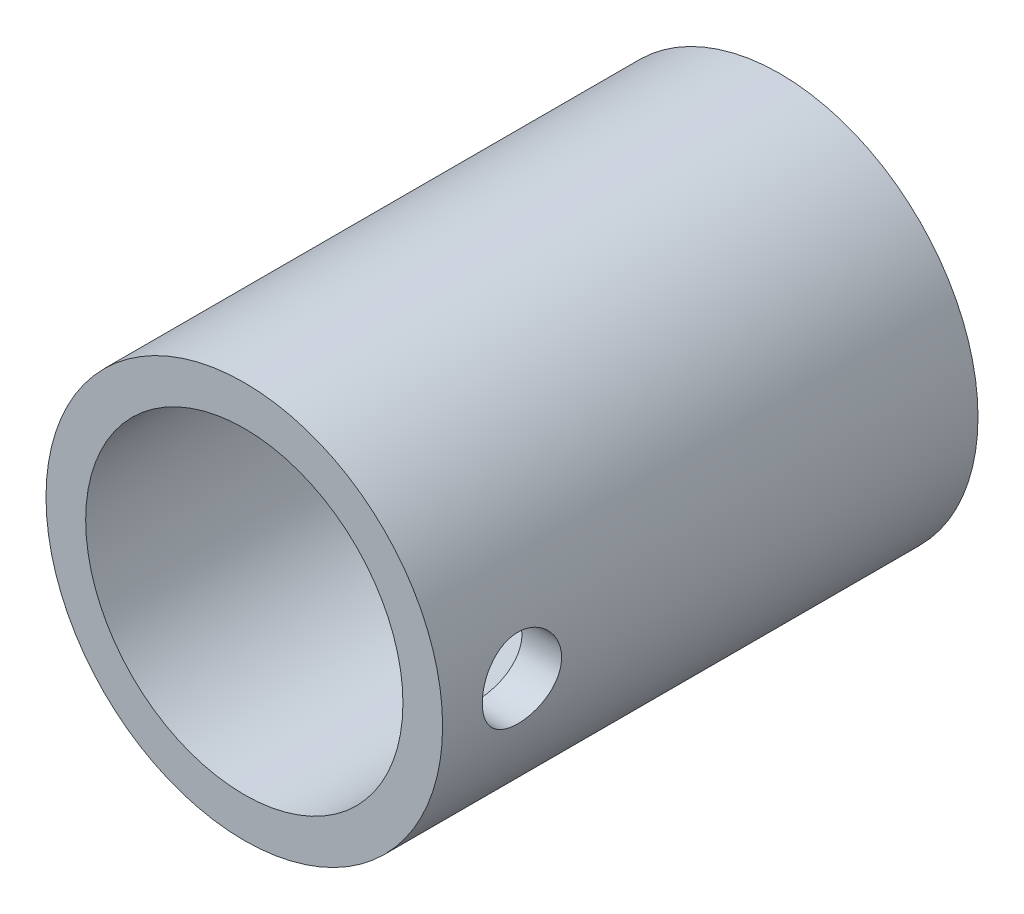
ISO-10303-21;
HEADER;
FILE_DESCRIPTION(('STEP AP214'),'2;1');
FILE_NAME('part.step','',(''),(''),'','','');
FILE_SCHEMA(('AUTOMOTIVE_DESIGN { 1 0 10303 214 1 1 1 1 }'));
ENDSEC;
DATA;
#1=APPLICATION_CONTEXT('core data for automotive mechanical design processes');
#2=APPLICATION_PROTOCOL_DEFINITION('international standard','automotive_design',2000,#1);
#3=PRODUCT_CONTEXT('',#1,'mechanical');
#4=PRODUCT('Part','Part','',(#3));
#5=PRODUCT_RELATED_PRODUCT_CATEGORY('part','',(#4));
#6=PRODUCT_DEFINITION_FORMATION('','',#4);
#7=PRODUCT_DEFINITION_CONTEXT('part definition',#1,'design');
#8=PRODUCT_DEFINITION('design','',#6,#7);
#9=PRODUCT_DEFINITION_SHAPE('','',#8);
#10=(LENGTH_UNIT() NAMED_UNIT(*) SI_UNIT(.MILLI.,.METRE.));
#11=(NAMED_UNIT(*) PLANE_ANGLE_UNIT() SI_UNIT($,.RADIAN.));
#12=(NAMED_UNIT(*) SI_UNIT($,.STERADIAN.) SOLID_ANGLE_UNIT());
#13=UNCERTAINTY_MEASURE_WITH_UNIT(LENGTH_MEASURE(1.E-05),#10,'distance_accuracy_value','');
#14=(GEOMETRIC_REPRESENTATION_CONTEXT(3) GLOBAL_UNCERTAINTY_ASSIGNED_CONTEXT((#13)) GLOBAL_UNIT_ASSIGNED_CONTEXT((#10,
#11,#12)) REPRESENTATION_CONTEXT('',''));
#15=CARTESIAN_POINT('',(0.,0.,0.));
#16=DIRECTION('',(0.,0.,1.));
#17=DIRECTION('',(1.,0.,0.));
#18=AXIS2_PLACEMENT_3D('',#15,#16,#17);
#19=CARTESIAN_POINT('',(0.,0.,13.5));
#20=DIRECTION('',(0.,0.,-1.));
#21=DIRECTION('',(-1.,0.,0.));
#22=AXIS2_PLACEMENT_3D('',#19,#20,#21);
#23=CYLINDRICAL_SURFACE('',#22,5.);
#24=CARTESIAN_POINT('',(0.,0.,13.5));
#25=DIRECTION('',(0.,0.,1.));
#26=DIRECTION('',(1.,0.,0.));
#27=AXIS2_PLACEMENT_3D('',#24,#25,#26);
#28=CIRCLE('',#27,5.);
#29=CARTESIAN_POINT('',(5.,0.,13.5));
#30=VERTEX_POINT('',#29);
#31=EDGE_CURVE('E10',#30,#30,#28,.T.);
#32=ORIENTED_EDGE('',*,*,#31,.F.);
#33=EDGE_LOOP('',(#32));
#34=FACE_BOUND('',#33,.T.);
#35=CARTESIAN_POINT('',(0.,0.,0.));
#36=DIRECTION('',(0.,0.,1.));
#37=DIRECTION('',(1.,0.,0.));
#38=AXIS2_PLACEMENT_3D('',#35,#36,#37);
#39=CIRCLE('',#38,5.);
#40=CARTESIAN_POINT('',(5.,0.,0.));
#41=VERTEX_POINT('',#40);
#42=EDGE_CURVE('E45',#41,#41,#39,.T.);
#43=ORIENTED_EDGE('',*,*,#42,.T.);
#44=EDGE_LOOP('',(#43));
#45=FACE_BOUND('',#44,.T.);
#46=CARTESIAN_POINT('',(5.,0.,12.5));
#47=CARTESIAN_POINT('',(4.99999897580871,-0.0555769067926333,12.4999979555017));
#48=CARTESIAN_POINT('',(4.99906385178231,-0.111179660201523,12.4953511570324));
#49=CARTESIAN_POINT('',(4.99542365623231,-0.22081350768902,12.4769014998848));
#50=CARTESIAN_POINT('',(4.99271717860186,-0.274843317541356,12.4630913671985));
#51=CARTESIAN_POINT('',(4.98583649278287,-0.379730305263313,12.4267587263792));
#52=CARTESIAN_POINT('',(4.98166369076718,-0.430590467933134,12.4042445631553));
#53=CARTESIAN_POINT('',(4.97230398035314,-0.527807988864225,12.3511677524887));
#54=CARTESIAN_POINT('',(4.96711713235707,-0.574165615075812,12.3206055843928));
#55=CARTESIAN_POINT('',(4.9562216532997,-0.661693477314866,12.2518615057086));
#56=CARTESIAN_POINT('',(4.95050745504347,-0.702793951158525,12.2135916446088));
#57=CARTESIAN_POINT('',(4.93924180452588,-0.778036756608029,12.1307075836083));
#58=CARTESIAN_POINT('',(4.93369036500424,-0.812178544770425,12.0860928886649));
#59=CARTESIAN_POINT('',(4.92332441812615,-0.872831753347621,11.9912838069881));
#60=CARTESIAN_POINT('',(4.91851707364946,-0.899270938865868,11.9410423562036));
#61=CARTESIAN_POINT('',(4.91026268058418,-0.943305666580309,11.8367181809959));
#62=CARTESIAN_POINT('',(4.90681549761962,-0.960902082437239,11.7826358366537));
#63=CARTESIAN_POINT('',(4.90172805252204,-0.986525299884828,11.6729156360921));
#64=CARTESIAN_POINT('',(4.90006470107188,-0.994674497958778,11.6173074558578));
#65=CARTESIAN_POINT('',(4.89866375060627,-1.00155212772612,11.5054901786357));
#66=CARTESIAN_POINT('',(4.89892595467841,-1.0002815227135,11.4492811436799));
#67=CARTESIAN_POINT('',(4.90132551148185,-0.98845457310182,11.338753211979));
#68=CARTESIAN_POINT('',(4.90343452858763,-0.978038540243907,11.2844185943727));
#69=CARTESIAN_POINT('',(4.90924546160001,-0.948437884623052,11.178283923337));
#70=CARTESIAN_POINT('',(4.91294745357779,-0.929252843100682,11.126483991081));
#71=CARTESIAN_POINT('',(4.92155618500408,-0.882524783674721,11.0264847382964));
#72=CARTESIAN_POINT('',(4.92647089813704,-0.854926151232116,10.9783121204308));
#73=CARTESIAN_POINT('',(4.93694618773062,-0.792193574572681,10.8872291500272));
#74=CARTESIAN_POINT('',(4.94250683838366,-0.75705876435683,10.8443194031488));
#75=CARTESIAN_POINT('',(4.95377021241462,-0.679499934560585,10.7641705975431));
#76=CARTESIAN_POINT('',(4.95947369210905,-0.636956161212446,10.7270474321409));
#77=CARTESIAN_POINT('',(4.97028848714408,-0.546185024062011,10.6604461536988));
#78=CARTESIAN_POINT('',(4.97539979488974,-0.49795758737939,10.6309681387064));
#79=CARTESIAN_POINT('',(4.98446690160887,-0.397059386878922,10.580472490774));
#80=CARTESIAN_POINT('',(4.98842088848272,-0.344381819585301,10.5594681063555));
#81=CARTESIAN_POINT('',(4.99471408987858,-0.236148976448666,10.5266395259614));
#82=CARTESIAN_POINT('',(4.99705350000531,-0.180594050072451,10.5148142179264));
#83=CARTESIAN_POINT('',(4.99982671866868,-0.0691794056271513,10.5008435462057));
#84=CARTESIAN_POINT('',(5.0002917465247,-0.0133403283255771,10.4985395804597));
#85=CARTESIAN_POINT('',(4.99935051930103,0.0979249341927132,10.5032498589422));
#86=CARTESIAN_POINT('',(4.99794436941446,0.153351142443792,10.5102635793526));
#87=CARTESIAN_POINT('',(4.99343832008018,0.26170565994654,10.533278373544));
#88=CARTESIAN_POINT('',(4.99035376404206,0.314651948339903,10.5491980684979));
#89=CARTESIAN_POINT('',(4.98283552061033,0.417123627499667,10.5894839826558));
#90=CARTESIAN_POINT('',(4.97840173214227,0.466648761637539,10.6138508346768));
#91=CARTESIAN_POINT('',(4.96859911533294,0.561541173686217,10.6706824906513));
#92=CARTESIAN_POINT('',(4.96321950437052,0.606850126752188,10.7032427810389));
#93=CARTESIAN_POINT('',(4.95214734829882,0.691418019119207,10.7754091912073));
#94=CARTESIAN_POINT('',(4.94645476968388,0.730676308930763,10.8150160663999));
#95=CARTESIAN_POINT('',(4.93529303556965,0.802640590774177,10.9008733518911));
#96=CARTESIAN_POINT('',(4.92982860233304,0.835237702448656,10.9472157442213));
#97=CARTESIAN_POINT('',(4.91984191796194,0.892185420051207,11.0448113613567));
#98=CARTESIAN_POINT('',(4.91531962913342,0.916536355922904,11.0960643895736));
#99=CARTESIAN_POINT('',(4.90776740584383,0.956151841581961,11.2017682461495));
#100=CARTESIAN_POINT('',(4.90472974872187,0.971463499791052,11.2562008412103));
#101=CARTESIAN_POINT('',(4.90047436792025,0.992708651627198,11.3669334534909));
#102=CARTESIAN_POINT('',(4.89925640691111,0.998643368225114,11.4232332262093));
#103=CARTESIAN_POINT('',(4.89879149631379,1.00092091086747,11.5350088645443));
#104=CARTESIAN_POINT('',(4.89950919189301,0.997435788070897,11.590481148927));
#105=CARTESIAN_POINT('',(4.90275573484614,0.981352304100062,11.700031649905));
#106=CARTESIAN_POINT('',(4.90528456767169,0.9687540161293,11.7541098776948));
#107=CARTESIAN_POINT('',(4.91185264219158,0.934878568498956,11.8592277112405));
#108=CARTESIAN_POINT('',(4.9158882101883,0.913622506717347,11.9102743605024));
#109=CARTESIAN_POINT('',(4.9250171497417,0.863054644601606,12.0081037207344));
#110=CARTESIAN_POINT('',(4.93011060998894,0.833742168774884,12.0548860737251));
#111=CARTESIAN_POINT('',(4.94088960523225,0.767305914786416,12.1437155721503));
#112=CARTESIAN_POINT('',(4.94658372909699,0.730057887235182,12.1856687652676));
#113=CARTESIAN_POINT('',(4.95786081871955,0.649064369013143,12.2627862055292));
#114=CARTESIAN_POINT('',(4.96344375863184,0.605317387153337,12.2979488903173));
#115=CARTESIAN_POINT('',(4.97393832387971,0.512017629088249,12.3608346439464));
#116=CARTESIAN_POINT('',(4.97884231219246,0.462408884429837,12.38847600328));
#117=CARTESIAN_POINT('',(4.98735125085,0.359166360940735,12.4349861225966));
#118=CARTESIAN_POINT('',(4.99095737138616,0.305536260863128,12.4538627895325));
#119=CARTESIAN_POINT('',(4.99576372595371,0.209821488923781,12.4786519480447));
#120=CARTESIAN_POINT('',(4.99734303158452,0.168281664013786,12.4866431937078));
#121=CARTESIAN_POINT('',(4.99946154139893,0.0844995252100676,12.4973179123584));
#122=CARTESIAN_POINT('',(5.00000077873155,0.0422572337486193,12.5000015545098));
#123=CARTESIAN_POINT('',(5.,0.,12.5));
#124=B_SPLINE_CURVE_WITH_KNOTS('',3,(#46,#47,#48,#49,#50,#51,#52,#53,#54,#55,#56,#57,#58,#59,
#60,#61,#62,#63,#64,#65,#66,#67,#68,#69,#70,#71,#72,#73,#74,#75,#76,#77,#78,#79,#80,#81,#82,#83,
#84,#85,#86,#87,#88,#89,#90,#91,#92,#93,#94,#95,#96,#97,#98,#99,#100,#101,#102,#103,#104,#105,
#106,#107,#108,#109,#110,#111,#112,#113,#114,#115,#116,#117,#118,#119,#120,#121,#122,#123),
.UNSPECIFIED.,.T.,.F.,(4,2,2,2,2,2,2,2,2,2,2,2,2,2,2,2,2,2,2,2,2,2,2,2,2,2,2,2,2,2,2,2,2,2,2,2,
2,2,4),(0.,0.166576130661259,0.333284650691323,0.499833735250341,0.666372902230863,
0.834932670112187,1.00350559674737,1.17361195005923,1.34370149365198,1.51156185103588,
1.67940504281225,1.84471727006278,2.0100373925373,2.17647490203593,2.34293154749671,
2.51238252491351,2.68183567539821,2.85155274854024,3.02124925698036,3.18810735676266,
3.35495607657868,3.52030453950724,3.68566539216023,3.85305066033359,4.02045388345931,
4.19040628579226,4.36035188723467,4.52940381032724,4.69843368330415,4.86439722567702,
5.03035943492609,5.19591961253111,5.36149367581867,5.52988076239144,5.69830654532931,
5.86849496675638,6.0385295551752,6.16518775289895,6.29184191370997),.UNSPECIFIED.);
#125=CARTESIAN_POINT('',(5.,0.,12.5));
#126=VERTEX_POINT('',#125);
#127=EDGE_CURVE('E55',#126,#126,#124,.T.);
#128=ORIENTED_EDGE('',*,*,#127,.F.);
#129=EDGE_LOOP('',(#128));
#130=FACE_BOUND('',#129,.T.);
#131=ADVANCED_FACE('F32',(#34,#45,#130),#23,.T.);
#132=CARTESIAN_POINT('',(0.,0.,13.5));
#133=DIRECTION('',(0.,0.,-1.));
#134=DIRECTION('',(-1.,0.,0.));
#135=AXIS2_PLACEMENT_3D('',#132,#133,#134);
#136=CYLINDRICAL_SURFACE('',#135,4.);
#137=CARTESIAN_POINT('',(0.,0.,0.));
#138=DIRECTION('',(0.,0.,1.));
#139=DIRECTION('',(1.,0.,0.));
#140=AXIS2_PLACEMENT_3D('',#137,#138,#139);
#141=CIRCLE('',#140,4.);
#142=CARTESIAN_POINT('',(4.,0.,0.));
#143=VERTEX_POINT('',#142);
#144=EDGE_CURVE('E52',#143,#143,#141,.T.);
#145=ORIENTED_EDGE('',*,*,#144,.F.);
#146=EDGE_LOOP('',(#145));
#147=FACE_BOUND('',#146,.T.);
#148=CARTESIAN_POINT('',(0.,0.,13.5));
#149=DIRECTION('',(0.,0.,1.));
#150=DIRECTION('',(1.,0.,0.));
#151=AXIS2_PLACEMENT_3D('',#148,#149,#150);
#152=CIRCLE('',#151,4.);
#153=CARTESIAN_POINT('',(4.,0.,13.5));
#154=VERTEX_POINT('',#153);
#155=EDGE_CURVE('E50',#154,#154,#152,.T.);
#156=ORIENTED_EDGE('',*,*,#155,.T.);
#157=EDGE_LOOP('',(#156));
#158=FACE_BOUND('',#157,.T.);
#159=CARTESIAN_POINT('',(4.,0.,12.5));
#160=CARTESIAN_POINT('',(3.99999906578675,-0.0552507257798208,12.4999984495079));
#161=CARTESIAN_POINT('',(3.99884385421219,-0.110518771887176,12.4954056328175));
#162=CARTESIAN_POINT('',(3.99434742553261,-0.219470882513689,12.477183232462));
#163=CARTESIAN_POINT('',(3.99100496946646,-0.273154031247159,12.4635485269748));
#164=CARTESIAN_POINT('',(3.98250417554693,-0.377347248121718,12.4277071643586));
#165=CARTESIAN_POINT('',(3.97734801894725,-0.42786104228667,12.4055108008565));
#166=CARTESIAN_POINT('',(3.96576895871729,-0.524448087936285,12.3532124066368));
#167=CARTESIAN_POINT('',(3.95934601236034,-0.57052118956584,12.323110109254));
#168=CARTESIAN_POINT('',(3.94578275727868,-0.657867951533947,12.2551994735639));
#169=CARTESIAN_POINT('',(3.93863138099022,-0.699037126707382,12.2172589500272));
#170=CARTESIAN_POINT('',(3.92449080078353,-0.774499284802204,12.1350318633941));
#171=CARTESIAN_POINT('',(3.91750161525566,-0.808791491299424,12.0907445847023));
#172=CARTESIAN_POINT('',(3.9043651713314,-0.870017695199356,11.9962698488417));
#173=CARTESIAN_POINT('',(3.89823196313737,-0.896834810616906,11.9460045127931));
#174=CARTESIAN_POINT('',(3.88766329874815,-0.941597939033686,11.8415010588944));
#175=CARTESIAN_POINT('',(3.88322757115192,-0.95954537029289,11.7872635777828));
#176=CARTESIAN_POINT('',(3.87666984478367,-0.985703224536195,11.6775043345317));
#177=CARTESIAN_POINT('',(3.87450327383617,-0.994101512222227,11.6220300693001));
#178=CARTESIAN_POINT('',(3.8725957502516,-1.00150785004524,11.5104209539907));
#179=CARTESIAN_POINT('',(3.87285440299096,-1.00051742787865,11.4542862128676));
#180=CARTESIAN_POINT('',(3.87572803664412,-0.989324349759522,11.3443894615037));
#181=CARTESIAN_POINT('',(3.87828575334586,-0.979345560127015,11.2906029190233));
#182=CARTESIAN_POINT('',(3.88537806450989,-0.950816124602073,11.1854926327258));
#183=CARTESIAN_POINT('',(3.88991279980464,-0.932264868046284,11.1341690646473));
#184=CARTESIAN_POINT('',(3.90050075936124,-0.886926318624771,11.0348413224986));
#185=CARTESIAN_POINT('',(3.90656884979614,-0.860057778155275,10.9868758854736));
#186=CARTESIAN_POINT('',(3.91953140564257,-0.79890418400997,10.8960541934954));
#187=CARTESIAN_POINT('',(3.9264260155649,-0.764617832539227,10.8531988346218));
#188=CARTESIAN_POINT('',(3.94050587026521,-0.688442283120812,10.7725309228704));
#189=CARTESIAN_POINT('',(3.94769379651981,-0.646364172110574,10.7348970066258));
#190=CARTESIAN_POINT('',(3.96137310385857,-0.556407945002467,10.6671858383574));
#191=CARTESIAN_POINT('',(3.96786446366277,-0.508529651805297,10.6371088171576));
#192=CARTESIAN_POINT('',(3.97945154729455,-0.408077259120929,10.5852996091837));
#193=CARTESIAN_POINT('',(3.9845424008515,-0.355487595472417,10.5635964398304));
#194=CARTESIAN_POINT('',(3.99271944660946,-0.247250672095256,10.5293884628603));
#195=CARTESIAN_POINT('',(3.99580602226187,-0.191603999433657,10.5168818957212));
#196=CARTESIAN_POINT('',(3.9995699951425,-0.0803599802600184,10.5016949562941));
#197=CARTESIAN_POINT('',(4.00030702338852,-0.0247978133254735,10.4987713159498));
#198=CARTESIAN_POINT('',(3.999458698763,0.0860219165343387,10.5021660013703));
#199=CARTESIAN_POINT('',(3.99787355494564,0.14127950642973,10.5084834951994));
#200=CARTESIAN_POINT('',(3.99259720751571,0.249076179184328,10.5299806055943));
#201=CARTESIAN_POINT('',(3.98893756123874,0.301643412645837,10.5450275089847));
#202=CARTESIAN_POINT('',(3.97992471089423,0.403504861635008,10.5834047226856));
#203=CARTESIAN_POINT('',(3.97457133579928,0.452798746021757,10.6067358695421));
#204=CARTESIAN_POINT('',(3.96262205284207,0.547682089619899,10.6614907525832));
#205=CARTESIAN_POINT('',(3.95600578244621,0.593190294557221,10.6930507415978));
#206=CARTESIAN_POINT('',(3.94229672791613,0.678351075762165,10.7631932725313));
#207=CARTESIAN_POINT('',(3.93520386167803,0.718002639315339,10.8017770264113));
#208=CARTESIAN_POINT('',(3.92112637973847,0.791327045381821,10.8860013072296));
#209=CARTESIAN_POINT('',(3.91414869458187,0.824829245081356,10.9317918020016));
#210=CARTESIAN_POINT('',(3.90128585584826,0.8836738393418,11.0284884229771));
#211=CARTESIAN_POINT('',(3.89540065378017,0.909016596105293,11.0793943219732));
#212=CARTESIAN_POINT('',(3.88545396489777,0.950634280406196,11.1846038149421));
#213=CARTESIAN_POINT('',(3.88138170194604,0.966962931102711,11.2388850855627));
#214=CARTESIAN_POINT('',(3.87551162726789,0.990230439969187,11.3495397585927));
#215=CARTESIAN_POINT('',(3.87371331813291,0.99717135165244,11.4059127006883));
#216=CARTESIAN_POINT('',(3.87263267469304,1.00135906022266,11.5174140159035));
#217=CARTESIAN_POINT('',(3.87327955152176,0.99887859852008,11.5725316234165));
#218=CARTESIAN_POINT('',(3.87685272671895,0.984918185541913,11.6815359257787));
#219=CARTESIAN_POINT('',(3.87977897927904,0.973438415124514,11.7354226453424));
#220=CARTESIAN_POINT('',(3.88754173788482,0.941954212961864,11.8401389727103));
#221=CARTESIAN_POINT('',(3.89236676824206,0.922000936453585,11.8909848701601));
#222=CARTESIAN_POINT('',(3.90338503816552,0.874176609070048,11.9886435884758));
#223=CARTESIAN_POINT('',(3.90957846747182,0.846304460022793,12.0354558487913));
#224=CARTESIAN_POINT('',(3.92283756175675,0.782578499091425,12.1250364193347));
#225=CARTESIAN_POINT('',(3.92992176554505,0.746535441941504,12.1676673822826));
#226=CARTESIAN_POINT('',(3.94405351497524,0.667859580793158,12.2463646965303));
#227=CARTESIAN_POINT('',(3.95110105151373,0.625225214174098,12.282429486742));
#228=CARTESIAN_POINT('',(3.96451770431775,0.533645057801728,12.3476075390431));
#229=CARTESIAN_POINT('',(3.97087222243912,0.484598948210926,12.3765830757811));
#230=CARTESIAN_POINT('',(3.98203283316746,0.382177373006985,12.4258316419604));
#231=CARTESIAN_POINT('',(3.98684003466521,0.328805042291161,12.446110907099));
#232=CARTESIAN_POINT('',(3.99365373043694,0.229606835495649,12.4743812202198));
#233=CARTESIAN_POINT('',(3.9960172336846,0.184253447272047,12.483967495369));
#234=CARTESIAN_POINT('',(3.99919070154632,0.0926040476908561,12.496777295748));
#235=CARTESIAN_POINT('',(4.00000078300596,0.0463081074950778,12.5000012995369));
#236=CARTESIAN_POINT('',(4.,0.,12.5));
#237=B_SPLINE_CURVE_WITH_KNOTS('',3,(#159,#160,#161,#162,#163,#164,#165,#166,#167,#168,#169,
#170,#171,#172,#173,#174,#175,#176,#177,#178,#179,#180,#181,#182,#183,#184,#185,#186,#187,#188,
#189,#190,#191,#192,#193,#194,#195,#196,#197,#198,#199,#200,#201,#202,#203,#204,#205,#206,#207,
#208,#209,#210,#211,#212,#213,#214,#215,#216,#217,#218,#219,#220,#221,#222,#223,#224,#225,#226,
#227,#228,#229,#230,#231,#232,#233,#234,#235,#236),.UNSPECIFIED.,.T.,.F.,(4,2,2,2,2,2,2,2,2,2,2,
2,2,2,2,2,2,2,2,2,2,2,2,2,2,2,2,2,2,2,2,2,2,2,2,2,2,2,4),(0.,0.16558247498126,0.331258825175933,
0.496736601524071,0.662219960112886,0.830762902914261,0.999324863867081,1.17039098363871,
1.34142974112912,1.50904196732954,1.67662692075131,1.84014998004679,2.00368468977359,
2.16887018582586,2.33408460557442,2.50401000646013,2.67394059705498,2.84445486006076,
3.01493649125762,3.18105539299518,3.34715934075162,3.51080183009359,3.67446084881527,
3.84102391710235,4.0076157533868,4.17829672802984,4.34897012499672,4.51861503076025,
4.68822282168272,4.85295853599075,5.0176909397069,5.18144267039632,5.34521712091268,
5.51326384273274,5.68135046513612,5.85248123666393,6.02348909214234,6.16228161961433,
6.30106370695361),.UNSPECIFIED.);
#238=CARTESIAN_POINT('',(4.,0.,12.5));
#239=VERTEX_POINT('',#238);
#240=EDGE_CURVE('E36',#239,#239,#237,.T.);
#241=ORIENTED_EDGE('',*,*,#240,.T.);
#242=EDGE_LOOP('',(#241));
#243=FACE_BOUND('',#242,.T.);
#244=ADVANCED_FACE('F67',(#147,#158,#243),#136,.F.);
#245=CARTESIAN_POINT('',(0.,0.,13.5));
#246=DIRECTION('',(0.,0.,1.));
#247=DIRECTION('',(1.,0.,0.));
#248=AXIS2_PLACEMENT_3D('',#245,#246,#247);
#249=PLANE('',#248);
#250=ORIENTED_EDGE('',*,*,#31,.T.);
#251=EDGE_LOOP('',(#250));
#252=FACE_BOUND('',#251,.T.);
#253=ORIENTED_EDGE('',*,*,#155,.F.);
#254=EDGE_LOOP('',(#253));
#255=FACE_BOUND('',#254,.T.);
#256=ADVANCED_FACE('F72',(#252,#255),#249,.T.);
#257=CARTESIAN_POINT('',(0.,0.,0.));
#258=DIRECTION('',(0.,0.,1.));
#259=DIRECTION('',(1.,0.,0.));
#260=AXIS2_PLACEMENT_3D('',#257,#258,#259);
#261=PLANE('',#260);
#262=ORIENTED_EDGE('',*,*,#42,.F.);
#263=EDGE_LOOP('',(#262));
#264=FACE_BOUND('',#263,.T.);
#265=ORIENTED_EDGE('',*,*,#144,.T.);
#266=EDGE_LOOP('',(#265));
#267=FACE_BOUND('',#266,.T.);
#268=ADVANCED_FACE('F65',(#264,#267),#261,.F.);
#269=CARTESIAN_POINT('',(6.5,0.,11.5));
#270=DIRECTION('',(-1.,0.,0.));
#271=DIRECTION('',(0.,0.,1.));
#272=AXIS2_PLACEMENT_3D('',#269,#270,#271);
#273=CYLINDRICAL_SURFACE('',#272,1.);
#274=ORIENTED_EDGE('',*,*,#240,.F.);
#275=EDGE_LOOP('',(#274));
#276=FACE_BOUND('',#275,.T.);
#277=ORIENTED_EDGE('',*,*,#127,.T.);
#278=EDGE_LOOP('',(#277));
#279=FACE_BOUND('',#278,.T.);
#280=ADVANCED_FACE('F62',(#276,#279),#273,.F.);
#281=CLOSED_SHELL('',(#131,#244,#256,#268,#280));
#282=MANIFOLD_SOLID_BREP('B2',#281);
#283=ADVANCED_BREP_SHAPE_REPRESENTATION('',(#18,#282),#14);
#284=SHAPE_DEFINITION_REPRESENTATION(#9,#283);
ENDSEC;
END-ISO-10303-21;
